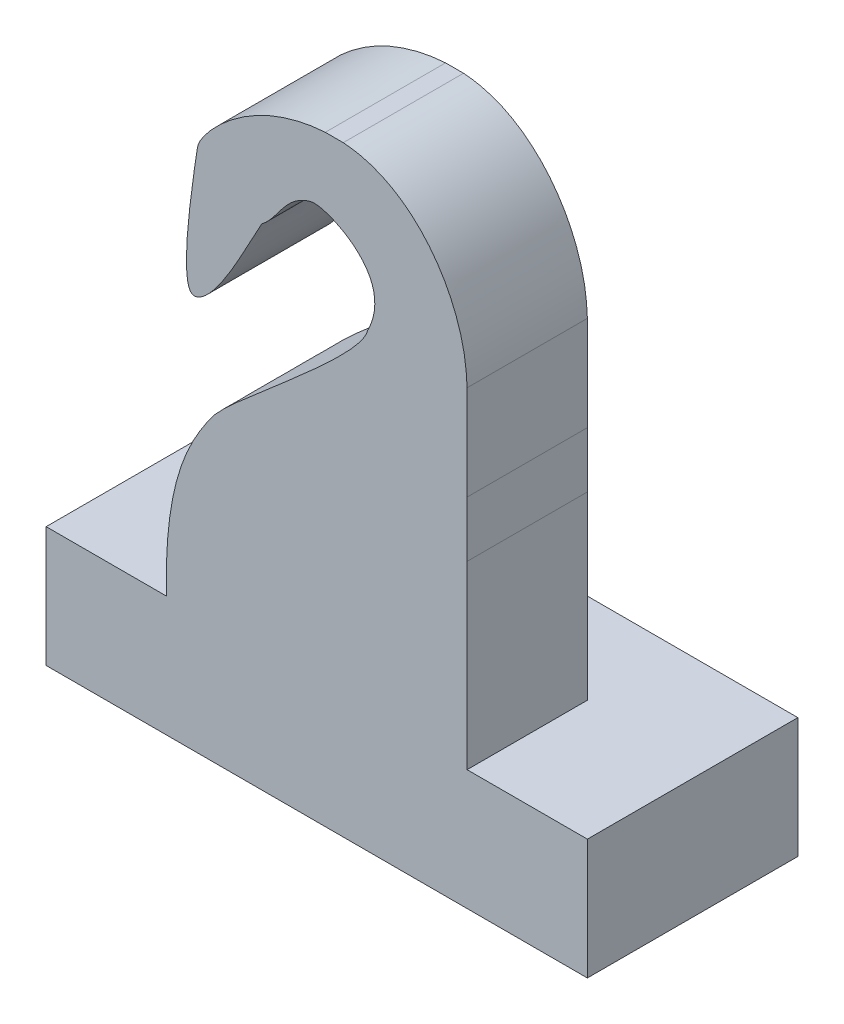
ISO-10303-21;
HEADER;
FILE_DESCRIPTION(('STEP AP214'),'2;1');
FILE_NAME('part.step','',(''),(''),'','','');
FILE_SCHEMA(('AUTOMOTIVE_DESIGN { 1 0 10303 214 1 1 1 1 }'));
ENDSEC;
DATA;
#1=APPLICATION_CONTEXT('core data for automotive mechanical design processes');
#2=APPLICATION_PROTOCOL_DEFINITION('international standard','automotive_design',2000,#1);
#3=PRODUCT_CONTEXT('',#1,'mechanical');
#4=PRODUCT('Part','Part','',(#3));
#5=PRODUCT_RELATED_PRODUCT_CATEGORY('part','',(#4));
#6=PRODUCT_DEFINITION_FORMATION('','',#4);
#7=PRODUCT_DEFINITION_CONTEXT('part definition',#1,'design');
#8=PRODUCT_DEFINITION('design','',#6,#7);
#9=PRODUCT_DEFINITION_SHAPE('','',#8);
#10=(LENGTH_UNIT() NAMED_UNIT(*) SI_UNIT(.MILLI.,.METRE.));
#11=(NAMED_UNIT(*) PLANE_ANGLE_UNIT() SI_UNIT($,.RADIAN.));
#12=(NAMED_UNIT(*) SI_UNIT($,.STERADIAN.) SOLID_ANGLE_UNIT());
#13=UNCERTAINTY_MEASURE_WITH_UNIT(LENGTH_MEASURE(1.E-05),#10,'distance_accuracy_value','');
#14=(GEOMETRIC_REPRESENTATION_CONTEXT(3) GLOBAL_UNCERTAINTY_ASSIGNED_CONTEXT((#13)) GLOBAL_UNIT_ASSIGNED_CONTEXT((#10,
#11,#12)) REPRESENTATION_CONTEXT('',''));
#15=CARTESIAN_POINT('',(0.,0.,0.));
#16=DIRECTION('',(0.,0.,1.));
#17=DIRECTION('',(1.,0.,0.));
#18=AXIS2_PLACEMENT_3D('',#15,#16,#17);
#19=CARTESIAN_POINT('',(2.5,2.,2.5));
#20=DIRECTION('',(-1.,0.,0.));
#21=DIRECTION('',(0.,0.,1.));
#22=AXIS2_PLACEMENT_3D('',#19,#20,#21);
#23=PLANE('',#22);
#24=DIRECTION('',(0.,-1.,0.));
#25=VECTOR('',#24,1.);
#26=CARTESIAN_POINT('',(2.5,10.,1.));
#27=LINE('',#26,#25);
#28=CARTESIAN_POINT('',(2.5,5.,1.));
#29=VERTEX_POINT('',#28);
#30=CARTESIAN_POINT('',(2.5,2.,1.));
#31=VERTEX_POINT('',#30);
#32=EDGE_CURVE('E135',#29,#31,#27,.T.);
#33=ORIENTED_EDGE('',*,*,#32,.T.);
#34=DIRECTION('',(0.,0.,-1.));
#35=VECTOR('',#34,1.);
#36=CARTESIAN_POINT('',(2.5,2.,2.5));
#37=LINE('',#36,#35);
#38=CARTESIAN_POINT('',(2.5,2.,-1.));
#39=VERTEX_POINT('',#38);
#40=EDGE_CURVE('E138',#31,#39,#37,.T.);
#41=ORIENTED_EDGE('',*,*,#40,.T.);
#42=DIRECTION('',(0.,-1.,0.));
#43=VECTOR('',#42,1.);
#44=CARTESIAN_POINT('',(2.5,10.,-1.));
#45=LINE('',#44,#43);
#46=CARTESIAN_POINT('',(2.5,5.,-1.));
#47=VERTEX_POINT('',#46);
#48=EDGE_CURVE('E222',#47,#39,#45,.T.);
#49=ORIENTED_EDGE('',*,*,#48,.F.);
#50=DIRECTION('',(0.,0.,1.));
#51=VECTOR('',#50,1.);
#52=CARTESIAN_POINT('',(2.5,5.,-2.500025));
#53=LINE('',#52,#51);
#54=EDGE_CURVE('E140',#47,#29,#53,.T.);
#55=ORIENTED_EDGE('',*,*,#54,.T.);
#56=EDGE_LOOP('',(#33,#41,#49,#55));
#57=FACE_BOUND('',#56,.T.);
#58=ADVANCED_FACE('F34',(#57),#23,.F.);
#59=DIRECTION('',(0.,0.,1.));
#60=VECTOR('',#59,1.);
#61=CARTESIAN_POINT('',(2.49999999999981,5.92572640395759,-2.500025));
#62=LINE('',#61,#60);
#63=CARTESIAN_POINT('',(2.4999999999999,5.92572640395759,-1.));
#64=VERTEX_POINT('',#63);
#65=CARTESIAN_POINT('',(2.5,5.92572638119853,1.));
#66=VERTEX_POINT('',#65);
#67=EDGE_CURVE('E49',#64,#66,#62,.T.);
#68=ORIENTED_EDGE('',*,*,#67,.F.);
#69=CARTESIAN_POINT('',(2.5,7.50000000000013,-1.));
#70=VERTEX_POINT('',#69);
#71=EDGE_CURVE('E310',#70,#64,#45,.T.);
#72=ORIENTED_EDGE('',*,*,#71,.F.);
#73=DIRECTION('',(0.,0.,1.));
#74=VECTOR('',#73,1.);
#75=CARTESIAN_POINT('',(2.5,7.49999999999997,-2.500025));
#76=LINE('',#75,#74);
#77=CARTESIAN_POINT('',(2.5,7.50000000000013,1.));
#78=VERTEX_POINT('',#77);
#79=EDGE_CURVE('E348',#78,#70,#76,.F.);
#80=ORIENTED_EDGE('',*,*,#79,.F.);
#81=EDGE_CURVE('E143',#78,#66,#27,.T.);
#82=ORIENTED_EDGE('',*,*,#81,.T.);
#83=EDGE_LOOP('',(#68,#72,#80,#82));
#84=FACE_BOUND('',#83,.T.);
#85=ADVANCED_FACE('F297',(#84),#23,.F.);
#86=CARTESIAN_POINT('',(-2.5,10.,-1.));
#87=DIRECTION('',(0.,0.,1.));
#88=DIRECTION('',(1.,0.,0.));
#89=AXIS2_PLACEMENT_3D('',#86,#87,#88);
#90=PLANE('',#89);
#91=CARTESIAN_POINT('',(2.5,4.99999999999999,-1.));
#92=CARTESIAN_POINT('',(2.49589033919262,5.3238455114131,-1.));
#93=CARTESIAN_POINT('',(2.49736885786771,5.62624553345062,-1.));
#94=CARTESIAN_POINT('',(2.49999999999981,5.92572640395759,-1.));
#95=B_SPLINE_CURVE_WITH_KNOTS('',3,(#91,#92,#93,#94),.UNSPECIFIED.,.F.,.F.,(4,4),(0.,
0.0676005936664288),.UNSPECIFIED.);
#96=EDGE_CURVE('E312',#47,#64,#95,.T.);
#97=ORIENTED_EDGE('',*,*,#96,.F.);
#98=ORIENTED_EDGE('',*,*,#48,.T.);
#99=DIRECTION('',(-1.,0.,0.));
#100=VECTOR('',#99,1.);
#101=CARTESIAN_POINT('',(-2.5,2.,-1.));
#102=LINE('',#101,#100);
#103=CARTESIAN_POINT('',(-2.5,2.,-1.));
#104=VERTEX_POINT('',#103);
#105=EDGE_CURVE('E154',#39,#104,#102,.T.);
#106=ORIENTED_EDGE('',*,*,#105,.T.);
#107=DIRECTION('',(0.,-1.,0.));
#108=VECTOR('',#107,1.);
#109=CARTESIAN_POINT('',(-2.5,10.,-1.));
#110=LINE('',#109,#108);
#111=CARTESIAN_POINT('',(-2.5,2.45113593006876,-1.));
#112=VERTEX_POINT('',#111);
#113=EDGE_CURVE('E218',#112,#104,#110,.T.);
#114=ORIENTED_EDGE('',*,*,#113,.F.);
#115=CARTESIAN_POINT('',(0.846399905186923,7.50000000000001,-1.));
#116=CARTESIAN_POINT('',(0.733429790840664,7.04375399604097,-1.));
#117=CARTESIAN_POINT('',(-1.46492465911326,5.35390022613394,-1.));
#118=CARTESIAN_POINT('',(-2.07816339811987,4.48956577341703,-1.));
#119=CARTESIAN_POINT('',(-2.53979583866904,3.63685244014865,-1.));
#120=CARTESIAN_POINT('',(-2.5,2.,-1.));
#121=B_SPLINE_CURVE_WITH_KNOTS('',3,(#115,#116,#117,#118,#119,#120),.UNSPECIFIED.,.F.,.F.,(4,1,
1,4),(0.,0.389814199321812,0.489814199321812,1.),.UNSPECIFIED.);
#122=CARTESIAN_POINT('',(0.846399905186923,7.50000000000001,-1.));
#123=VERTEX_POINT('',#122);
#124=EDGE_CURVE('E227',#123,#112,#121,.T.);
#125=ORIENTED_EDGE('',*,*,#124,.F.);
#126=CARTESIAN_POINT('',(-0.913797876336708,8.15435335652131,-1.));
#127=CARTESIAN_POINT('',(-0.648759023753295,8.34710888567288,-1.));
#128=CARTESIAN_POINT('',(-0.531494103816482,8.78498809469441,-1.));
#129=CARTESIAN_POINT('',(0.146387491870617,8.94336174341602,-1.));
#130=CARTESIAN_POINT('',(1.26948792852301,8.33205645916082,-1.));
#131=CARTESIAN_POINT('',(0.846399905186921,7.5,-1.));
#132=B_SPLINE_CURVE_WITH_KNOTS('',3,(#126,#127,#128,#129,#130,#131),.UNSPECIFIED.,.F.,.F.,(4,1,
1,4),(0.,0.636793482911564,0.736793482911564,1.),.UNSPECIFIED.);
#133=CARTESIAN_POINT('',(-0.913797876336708,8.15435335652131,-1.));
#134=VERTEX_POINT('',#133);
#135=EDGE_CURVE('E342',#134,#123,#132,.T.);
#136=ORIENTED_EDGE('',*,*,#135,.F.);
#137=CARTESIAN_POINT('',(2.5,4.99999999999999,-1.));
#138=CARTESIAN_POINT('',(2.49007762198309,5.78189362429881,-1.));
#139=CARTESIAN_POINT('',(2.5185939913796,6.60879597252504,-1.));
#140=CARTESIAN_POINT('',(2.48216557116695,8.62899466353741,-1.));
#141=CARTESIAN_POINT('',(1.4312796744746,10.1046934894448,-1.));
#142=CARTESIAN_POINT('',(-1.04972267407301,9.922936438262,-1.));
#143=CARTESIAN_POINT('',(-1.95055727861318,8.93686203342009,-1.));
#144=CARTESIAN_POINT('',(-2.00518478576261,8.58785633115242,-1.));
#145=CARTESIAN_POINT('',(-2.3250371117742,6.45528619828981,-1.));
#146=CARTESIAN_POINT('',(-1.65527522698245,6.650653781453,-1.));
#147=CARTESIAN_POINT('',(-1.14029070231076,7.76401465643836,-1.));
#148=CARTESIAN_POINT('',(-0.913797876336707,8.15435335652131,-1.));
#149=B_SPLINE_CURVE_WITH_KNOTS('',3,(#137,#138,#139,#140,#141,#142,#143,#144,#145,#146,#147,
#148),.UNSPECIFIED.,.F.,.F.,(4,1,1,1,1,1,1,1,1,4),(0.,0.163215086588525,0.205460406152552,
0.398342885697188,0.445021291960526,0.625566062522596,0.664836846691589,0.798458349481464,
0.833644933597179,1.),.UNSPECIFIED.);
#150=CARTESIAN_POINT('',(0.141785375792142,10.,-1.));
#151=VERTEX_POINT('',#150);
#152=EDGE_CURVE('E337',#151,#134,#149,.T.);
#153=ORIENTED_EDGE('',*,*,#152,.F.);
#154=DIRECTION('',(-1.,0.,0.));
#155=VECTOR('',#154,1.);
#156=CARTESIAN_POINT('',(-2.5,10.,-1.));
#157=LINE('',#156,#155);
#158=CARTESIAN_POINT('',(0.440648573603054,10.,-1.));
#159=VERTEX_POINT('',#158);
#160=EDGE_CURVE('E226',#159,#151,#157,.T.);
#161=ORIENTED_EDGE('',*,*,#160,.F.);
#162=EDGE_CURVE('E318',#70,#159,#149,.T.);
#163=ORIENTED_EDGE('',*,*,#162,.F.);
#164=ORIENTED_EDGE('',*,*,#71,.T.);
#165=EDGE_LOOP('',(#97,#98,#106,#114,#125,#136,#153,#161,#163,#164));
#166=FACE_BOUND('',#165,.T.);
#167=ADVANCED_FACE('F225',(#166),#90,.F.);
#168=CARTESIAN_POINT('',(-2.5,10.,1.));
#169=DIRECTION('',(0.,0.,-1.));
#170=DIRECTION('',(-1.,0.,0.));
#171=AXIS2_PLACEMENT_3D('',#168,#169,#170);
#172=PLANE('',#171);
#173=CARTESIAN_POINT('',(2.5,4.99999999999999,1.));
#174=CARTESIAN_POINT('',(2.49007762198309,5.78189362429881,1.));
#175=CARTESIAN_POINT('',(2.5185939913796,6.60879597252504,1.));
#176=CARTESIAN_POINT('',(2.48216557116695,8.62899466353741,1.));
#177=CARTESIAN_POINT('',(1.4312796744746,10.1046934894448,1.));
#178=CARTESIAN_POINT('',(-1.04972267407301,9.922936438262,1.));
#179=CARTESIAN_POINT('',(-1.95055727861318,8.93686203342009,1.));
#180=CARTESIAN_POINT('',(-2.00518478576261,8.58785633115242,1.));
#181=CARTESIAN_POINT('',(-2.3250371117742,6.45528619828981,1.));
#182=CARTESIAN_POINT('',(-1.65527522698245,6.650653781453,1.));
#183=CARTESIAN_POINT('',(-1.14029070231076,7.76401465643836,1.));
#184=CARTESIAN_POINT('',(-0.913797876336707,8.15435335652131,1.));
#185=B_SPLINE_CURVE_WITH_KNOTS('',3,(#173,#174,#175,#176,#177,#178,#179,#180,#181,#182,#183,
#184),.UNSPECIFIED.,.F.,.F.,(4,1,1,1,1,1,1,1,1,4),(0.,0.163215086588525,0.205460406152552,
0.398342885697188,0.445021291960526,0.625566062522596,0.664836846691589,0.798458349481464,
0.833644933597179,1.),.UNSPECIFIED.);
#186=CARTESIAN_POINT('',(0.440648573603055,10.,1.));
#187=VERTEX_POINT('',#186);
#188=EDGE_CURVE('E343',#187,#78,#185,.F.);
#189=ORIENTED_EDGE('',*,*,#188,.F.);
#190=DIRECTION('',(1.,0.,0.));
#191=VECTOR('',#190,1.);
#192=CARTESIAN_POINT('',(-2.5,10.,1.));
#193=LINE('',#192,#191);
#194=CARTESIAN_POINT('',(0.141785375792142,10.,1.));
#195=VERTEX_POINT('',#194);
#196=EDGE_CURVE('E144',#195,#187,#193,.T.);
#197=ORIENTED_EDGE('',*,*,#196,.F.);
#198=CARTESIAN_POINT('',(-0.913797876336708,8.15435335652131,1.));
#199=VERTEX_POINT('',#198);
#200=EDGE_CURVE('E57',#199,#195,#185,.F.);
#201=ORIENTED_EDGE('',*,*,#200,.F.);
#202=CARTESIAN_POINT('',(-0.913797876336708,8.15435335652131,1.));
#203=CARTESIAN_POINT('',(-0.648759023753295,8.34710888567288,1.));
#204=CARTESIAN_POINT('',(-0.531494103816482,8.78498809469441,1.));
#205=CARTESIAN_POINT('',(0.146387491870617,8.94336174341602,1.));
#206=CARTESIAN_POINT('',(1.26948792852301,8.33205645916082,1.));
#207=CARTESIAN_POINT('',(0.846399905186921,7.5,1.));
#208=B_SPLINE_CURVE_WITH_KNOTS('',3,(#202,#203,#204,#205,#206,#207),.UNSPECIFIED.,.F.,.F.,(4,1,
1,4),(0.,0.636793482911564,0.736793482911564,1.),.UNSPECIFIED.);
#209=CARTESIAN_POINT('',(0.846399905186923,7.50000000000001,1.));
#210=VERTEX_POINT('',#209);
#211=EDGE_CURVE('E335',#210,#199,#208,.F.);
#212=ORIENTED_EDGE('',*,*,#211,.F.);
#213=CARTESIAN_POINT('',(0.846399905186923,7.50000000000001,1.));
#214=CARTESIAN_POINT('',(0.733429790840664,7.04375399604097,1.));
#215=CARTESIAN_POINT('',(-1.46492465911326,5.35390022613394,1.));
#216=CARTESIAN_POINT('',(-2.07816339811987,4.48956577341703,1.));
#217=CARTESIAN_POINT('',(-2.53979583866904,3.63685244014865,1.));
#218=CARTESIAN_POINT('',(-2.5,2.,1.));
#219=B_SPLINE_CURVE_WITH_KNOTS('',3,(#213,#214,#215,#216,#217,#218),.UNSPECIFIED.,.F.,.F.,(4,1,
1,4),(0.,0.389814199321812,0.489814199321812,1.),.UNSPECIFIED.);
#220=CARTESIAN_POINT('',(-2.49999999999998,2.45113593006974,1.));
#221=VERTEX_POINT('',#220);
#222=EDGE_CURVE('E42',#221,#210,#219,.F.);
#223=ORIENTED_EDGE('',*,*,#222,.F.);
#224=DIRECTION('',(0.,-1.,0.));
#225=VECTOR('',#224,1.);
#226=CARTESIAN_POINT('',(-2.5,10.,1.));
#227=LINE('',#226,#225);
#228=CARTESIAN_POINT('',(-2.5,2.,1.));
#229=VERTEX_POINT('',#228);
#230=EDGE_CURVE('E213',#221,#229,#227,.T.);
#231=ORIENTED_EDGE('',*,*,#230,.T.);
#232=DIRECTION('',(1.,0.,0.));
#233=VECTOR('',#232,1.);
#234=CARTESIAN_POINT('',(-4.5,2.,1.));
#235=LINE('',#234,#233);
#236=CARTESIAN_POINT('',(-4.5,2.,1.));
#237=VERTEX_POINT('',#236);
#238=EDGE_CURVE('E156',#237,#229,#235,.T.);
#239=ORIENTED_EDGE('',*,*,#238,.F.);
#240=DIRECTION('',(0.,-1.,0.));
#241=VECTOR('',#240,1.);
#242=CARTESIAN_POINT('',(-4.5,2.,1.));
#243=LINE('',#242,#241);
#244=CARTESIAN_POINT('',(-4.5,0.,1.));
#245=VERTEX_POINT('',#244);
#246=EDGE_CURVE('E183',#237,#245,#243,.T.);
#247=ORIENTED_EDGE('',*,*,#246,.T.);
#248=DIRECTION('',(1.,0.,0.));
#249=VECTOR('',#248,1.);
#250=CARTESIAN_POINT('',(-4.5,0.,1.));
#251=LINE('',#250,#249);
#252=CARTESIAN_POINT('',(4.5,0.,1.));
#253=VERTEX_POINT('',#252);
#254=EDGE_CURVE('E163',#245,#253,#251,.T.);
#255=ORIENTED_EDGE('',*,*,#254,.T.);
#256=DIRECTION('',(0.,-1.,0.));
#257=VECTOR('',#256,1.);
#258=CARTESIAN_POINT('',(4.5,2.,1.));
#259=LINE('',#258,#257);
#260=CARTESIAN_POINT('',(4.5,2.,1.));
#261=VERTEX_POINT('',#260);
#262=EDGE_CURVE('E162',#261,#253,#259,.T.);
#263=ORIENTED_EDGE('',*,*,#262,.F.);
#264=EDGE_CURVE('E150',#31,#261,#235,.T.);
#265=ORIENTED_EDGE('',*,*,#264,.F.);
#266=ORIENTED_EDGE('',*,*,#32,.F.);
#267=CARTESIAN_POINT('',(2.49999999979986,5.9257263811994,1.));
#268=CARTESIAN_POINT('',(2.49736885779281,5.62624551813061,1.));
#269=CARTESIAN_POINT('',(2.49589033929672,5.32384550320986,1.));
#270=CARTESIAN_POINT('',(2.5,4.99999999999999,1.));
#271=B_SPLINE_CURVE_WITH_KNOTS('',3,(#267,#268,#269,#270),.UNSPECIFIED.,.F.,.F.,(4,4),(0.,
0.0676005919540581),.UNSPECIFIED.);
#272=EDGE_CURVE('E313',#66,#29,#271,.T.);
#273=ORIENTED_EDGE('',*,*,#272,.F.);
#274=ORIENTED_EDGE('',*,*,#81,.F.);
#275=EDGE_LOOP('',(#189,#197,#201,#212,#223,#231,#239,#247,#255,#263,#265,#266,#273,#274));
#276=FACE_BOUND('',#275,.T.);
#277=ADVANCED_FACE('F160',(#276),#172,.F.);
#278=CARTESIAN_POINT('',(0.,10.,0.));
#279=DIRECTION('',(0.,-1.,0.));
#280=DIRECTION('',(0.,0.,-1.));
#281=AXIS2_PLACEMENT_3D('',#278,#279,#280);
#282=PLANE('',#281);
#283=DIRECTION('',(0.,0.,1.));
#284=VECTOR('',#283,1.);
#285=CARTESIAN_POINT('',(0.440648573603055,10.,-2.500025));
#286=LINE('',#285,#284);
#287=EDGE_CURVE('E334',#159,#187,#286,.T.);
#288=ORIENTED_EDGE('',*,*,#287,.F.);
#289=ORIENTED_EDGE('',*,*,#160,.T.);
#290=DIRECTION('',(0.,0.,1.));
#291=VECTOR('',#290,1.);
#292=CARTESIAN_POINT('',(0.141785375792142,10.,-2.500025));
#293=LINE('',#292,#291);
#294=EDGE_CURVE('E201',#195,#151,#293,.F.);
#295=ORIENTED_EDGE('',*,*,#294,.F.);
#296=ORIENTED_EDGE('',*,*,#196,.T.);
#297=EDGE_LOOP('',(#288,#289,#295,#296));
#298=FACE_BOUND('',#297,.T.);
#299=ADVANCED_FACE('F262',(#298),#282,.F.);
#300=CARTESIAN_POINT('',(0.,2.,0.));
#301=DIRECTION('',(0.,-1.,0.));
#302=DIRECTION('',(0.,0.,-1.));
#303=AXIS2_PLACEMENT_3D('',#300,#301,#302);
#304=PLANE('',#303);
#305=ORIENTED_EDGE('',*,*,#105,.F.);
#306=ORIENTED_EDGE('',*,*,#40,.F.);
#307=ORIENTED_EDGE('',*,*,#264,.T.);
#308=DIRECTION('',(0.,0.,1.));
#309=VECTOR('',#308,1.);
#310=CARTESIAN_POINT('',(4.5,2.,1.));
#311=LINE('',#310,#309);
#312=CARTESIAN_POINT('',(4.5,2.,-2.5));
#313=VERTEX_POINT('',#312);
#314=EDGE_CURVE('E186',#313,#261,#311,.T.);
#315=ORIENTED_EDGE('',*,*,#314,.F.);
#316=DIRECTION('',(-1.,0.,0.));
#317=VECTOR('',#316,1.);
#318=CARTESIAN_POINT('',(-2.5,2.,-2.5));
#319=LINE('',#318,#317);
#320=CARTESIAN_POINT('',(-4.5,2.,-2.5));
#321=VERTEX_POINT('',#320);
#322=EDGE_CURVE('E198',#313,#321,#319,.T.);
#323=ORIENTED_EDGE('',*,*,#322,.T.);
#324=DIRECTION('',(0.,0.,1.));
#325=VECTOR('',#324,1.);
#326=CARTESIAN_POINT('',(-4.5,2.,1.));
#327=LINE('',#326,#325);
#328=EDGE_CURVE('E167',#321,#237,#327,.T.);
#329=ORIENTED_EDGE('',*,*,#328,.T.);
#330=ORIENTED_EDGE('',*,*,#238,.T.);
#331=DIRECTION('',(0.,0.,1.));
#332=VECTOR('',#331,1.);
#333=CARTESIAN_POINT('',(-2.5,2.,2.5));
#334=LINE('',#333,#332);
#335=EDGE_CURVE('E12',#104,#229,#334,.T.);
#336=ORIENTED_EDGE('',*,*,#335,.F.);
#337=EDGE_LOOP('',(#305,#306,#307,#315,#323,#329,#330,#336));
#338=FACE_BOUND('',#337,.T.);
#339=ADVANCED_FACE('F148',(#338),#304,.F.);
#340=CARTESIAN_POINT('',(-2.5,2.,-2.5));
#341=DIRECTION('',(0.,0.,1.));
#342=DIRECTION('',(1.,0.,0.));
#343=AXIS2_PLACEMENT_3D('',#340,#341,#342);
#344=PLANE('',#343);
#345=DIRECTION('',(-1.,0.,0.));
#346=VECTOR('',#345,1.);
#347=CARTESIAN_POINT('',(-2.5,0.,-2.5));
#348=LINE('',#347,#346);
#349=CARTESIAN_POINT('',(4.5,0.,-2.5));
#350=VERTEX_POINT('',#349);
#351=CARTESIAN_POINT('',(-4.5,0.,-2.5));
#352=VERTEX_POINT('',#351);
#353=EDGE_CURVE('E202',#350,#352,#348,.T.);
#354=ORIENTED_EDGE('',*,*,#353,.T.);
#355=DIRECTION('',(0.,1.,0.));
#356=VECTOR('',#355,1.);
#357=CARTESIAN_POINT('',(-4.5,2.,-2.5));
#358=LINE('',#357,#356);
#359=EDGE_CURVE('E177',#352,#321,#358,.T.);
#360=ORIENTED_EDGE('',*,*,#359,.T.);
#361=ORIENTED_EDGE('',*,*,#322,.F.);
#362=DIRECTION('',(0.,1.,0.));
#363=VECTOR('',#362,1.);
#364=CARTESIAN_POINT('',(4.5,2.,-2.5));
#365=LINE('',#364,#363);
#366=EDGE_CURVE('E188',#350,#313,#365,.T.);
#367=ORIENTED_EDGE('',*,*,#366,.F.);
#368=EDGE_LOOP('',(#354,#360,#361,#367));
#369=FACE_BOUND('',#368,.T.);
#370=ADVANCED_FACE('F205',(#369),#344,.F.);
#371=CARTESIAN_POINT('',(-2.5,2.,2.5));
#372=DIRECTION('',(1.,0.,0.));
#373=DIRECTION('',(0.,0.,-1.));
#374=AXIS2_PLACEMENT_3D('',#371,#372,#373);
#375=PLANE('',#374);
#376=ORIENTED_EDGE('',*,*,#113,.T.);
#377=ORIENTED_EDGE('',*,*,#335,.T.);
#378=ORIENTED_EDGE('',*,*,#230,.F.);
#379=DIRECTION('',(0.,0.,1.));
#380=VECTOR('',#379,1.);
#381=CARTESIAN_POINT('',(-2.5,2.45113593006876,-2.500025));
#382=LINE('',#381,#380);
#383=EDGE_CURVE('E219',#112,#221,#382,.T.);
#384=ORIENTED_EDGE('',*,*,#383,.F.);
#385=EDGE_LOOP('',(#376,#377,#378,#384));
#386=FACE_BOUND('',#385,.T.);
#387=ADVANCED_FACE('F215',(#386),#375,.F.);
#388=CARTESIAN_POINT('',(0.,0.,0.));
#389=DIRECTION('',(0.,-1.,0.));
#390=DIRECTION('',(0.,0.,-1.));
#391=AXIS2_PLACEMENT_3D('',#388,#389,#390);
#392=PLANE('',#391);
#393=ORIENTED_EDGE('',*,*,#254,.F.);
#394=DIRECTION('',(0.,0.,-1.));
#395=VECTOR('',#394,1.);
#396=CARTESIAN_POINT('',(-4.5,0.,1.));
#397=LINE('',#396,#395);
#398=EDGE_CURVE('E180',#245,#352,#397,.T.);
#399=ORIENTED_EDGE('',*,*,#398,.T.);
#400=ORIENTED_EDGE('',*,*,#353,.F.);
#401=DIRECTION('',(0.,0.,-1.));
#402=VECTOR('',#401,1.);
#403=CARTESIAN_POINT('',(4.5,0.,1.));
#404=LINE('',#403,#402);
#405=EDGE_CURVE('E191',#253,#350,#404,.T.);
#406=ORIENTED_EDGE('',*,*,#405,.F.);
#407=EDGE_LOOP('',(#393,#399,#400,#406));
#408=FACE_BOUND('',#407,.T.);
#409=ADVANCED_FACE('F395',(#408),#392,.T.);
#410=CARTESIAN_POINT('',(2.5,4.99999999999999,-2.500025));
#411=CARTESIAN_POINT('',(2.49007762198309,5.78189362429881,-2.500025));
#412=CARTESIAN_POINT('',(2.5185939913796,6.60879597252504,-2.500025));
#413=CARTESIAN_POINT('',(2.48216557116695,8.62899466353741,-2.500025));
#414=CARTESIAN_POINT('',(1.4312796744746,10.1046934894448,-2.500025));
#415=CARTESIAN_POINT('',(-1.04972267407301,9.922936438262,-2.500025));
#416=CARTESIAN_POINT('',(-1.95055727861318,8.93686203342009,-2.500025));
#417=CARTESIAN_POINT('',(-2.00518478576261,8.58785633115242,-2.500025));
#418=CARTESIAN_POINT('',(-2.3250371117742,6.45528619828981,-2.500025));
#419=CARTESIAN_POINT('',(-1.65527522698245,6.650653781453,-2.500025));
#420=CARTESIAN_POINT('',(-1.14029070231076,7.76401465643836,-2.500025));
#421=CARTESIAN_POINT('',(-0.913797876336707,8.15435335652131,-2.500025));
#422=B_SPLINE_CURVE_WITH_KNOTS('',3,(#410,#411,#412,#413,#414,#415,#416,#417,#418,#419,#420,
#421),.UNSPECIFIED.,.F.,.F.,(4,1,1,1,1,1,1,1,1,4),(0.,0.163215086588525,0.205460406152552,
0.398342885697188,0.445021291960526,0.625566062522596,0.664836846691589,0.798458349481464,
0.833644933597179,1.),.UNSPECIFIED.);
#423=DIRECTION('',(0.,0.,1.));
#424=VECTOR('',#423,1.);
#425=SURFACE_OF_LINEAR_EXTRUSION('',#422,#424);
#426=ORIENTED_EDGE('',*,*,#152,.T.);
#427=DIRECTION('',(0.,0.,1.));
#428=VECTOR('',#427,1.);
#429=CARTESIAN_POINT('',(-0.913797876336708,8.15435335652131,-2.500025));
#430=LINE('',#429,#428);
#431=EDGE_CURVE('E155',#134,#199,#430,.T.);
#432=ORIENTED_EDGE('',*,*,#431,.T.);
#433=ORIENTED_EDGE('',*,*,#200,.T.);
#434=ORIENTED_EDGE('',*,*,#294,.T.);
#435=EDGE_LOOP('',(#426,#432,#433,#434));
#436=FACE_BOUND('',#435,.T.);
#437=ADVANCED_FACE('F258',(#436),#425,.T.);
#438=CARTESIAN_POINT('',(-0.913797876336708,8.15435335652131,-2.500025));
#439=CARTESIAN_POINT('',(-0.648759023753295,8.34710888567288,-2.500025));
#440=CARTESIAN_POINT('',(-0.531494103816482,8.78498809469441,-2.500025));
#441=CARTESIAN_POINT('',(0.146387491870617,8.94336174341602,-2.500025));
#442=CARTESIAN_POINT('',(1.26948792852301,8.33205645916082,-2.500025));
#443=CARTESIAN_POINT('',(0.846399905186921,7.5,-2.500025));
#444=B_SPLINE_CURVE_WITH_KNOTS('',3,(#438,#439,#440,#441,#442,#443),.UNSPECIFIED.,.F.,.F.,(4,1,
1,4),(0.,0.636793482911564,0.736793482911564,1.),.UNSPECIFIED.);
#445=DIRECTION('',(0.,0.,1.));
#446=VECTOR('',#445,1.);
#447=SURFACE_OF_LINEAR_EXTRUSION('',#444,#446);
#448=ORIENTED_EDGE('',*,*,#135,.T.);
#449=DIRECTION('',(0.,0.,1.));
#450=VECTOR('',#449,1.);
#451=CARTESIAN_POINT('',(0.846399905186923,7.50000000000001,-2.500025));
#452=LINE('',#451,#450);
#453=EDGE_CURVE('E352',#123,#210,#452,.T.);
#454=ORIENTED_EDGE('',*,*,#453,.T.);
#455=ORIENTED_EDGE('',*,*,#211,.T.);
#456=ORIENTED_EDGE('',*,*,#431,.F.);
#457=EDGE_LOOP('',(#448,#454,#455,#456));
#458=FACE_BOUND('',#457,.T.);
#459=ADVANCED_FACE('F259',(#458),#447,.T.);
#460=CARTESIAN_POINT('',(0.846399905186923,7.50000000000001,-2.500025));
#461=CARTESIAN_POINT('',(0.733429790840664,7.04375399604097,-2.500025));
#462=CARTESIAN_POINT('',(-1.46492465911326,5.35390022613394,-2.500025));
#463=CARTESIAN_POINT('',(-2.07816339811987,4.48956577341703,-2.500025));
#464=CARTESIAN_POINT('',(-2.53979583866904,3.63685244014865,-2.500025));
#465=CARTESIAN_POINT('',(-2.5,2.,-2.500025));
#466=B_SPLINE_CURVE_WITH_KNOTS('',3,(#460,#461,#462,#463,#464,#465),.UNSPECIFIED.,.F.,.F.,(4,1,
1,4),(0.,0.389814199321812,0.489814199321812,1.),.UNSPECIFIED.);
#467=DIRECTION('',(0.,0.,1.));
#468=VECTOR('',#467,1.);
#469=SURFACE_OF_LINEAR_EXTRUSION('',#466,#468);
#470=ORIENTED_EDGE('',*,*,#124,.T.);
#471=ORIENTED_EDGE('',*,*,#383,.T.);
#472=ORIENTED_EDGE('',*,*,#222,.T.);
#473=ORIENTED_EDGE('',*,*,#453,.F.);
#474=EDGE_LOOP('',(#470,#471,#472,#473));
#475=FACE_BOUND('',#474,.T.);
#476=ADVANCED_FACE('F287',(#475),#469,.T.);
#477=ORIENTED_EDGE('',*,*,#79,.T.);
#478=ORIENTED_EDGE('',*,*,#162,.T.);
#479=ORIENTED_EDGE('',*,*,#287,.T.);
#480=ORIENTED_EDGE('',*,*,#188,.T.);
#481=EDGE_LOOP('',(#477,#478,#479,#480));
#482=FACE_BOUND('',#481,.T.);
#483=ADVANCED_FACE('F257',(#482),#425,.T.);
#484=ORIENTED_EDGE('',*,*,#96,.T.);
#485=ORIENTED_EDGE('',*,*,#67,.T.);
#486=ORIENTED_EDGE('',*,*,#272,.T.);
#487=ORIENTED_EDGE('',*,*,#54,.F.);
#488=EDGE_LOOP('',(#484,#485,#486,#487));
#489=FACE_BOUND('',#488,.T.);
#490=ADVANCED_FACE('F246',(#489),#425,.T.);
#491=CARTESIAN_POINT('',(-4.5,0.,0.));
#492=DIRECTION('',(1.,0.,0.));
#493=DIRECTION('',(0.,0.,-1.));
#494=AXIS2_PLACEMENT_3D('',#491,#492,#493);
#495=PLANE('',#494);
#496=ORIENTED_EDGE('',*,*,#246,.F.);
#497=ORIENTED_EDGE('',*,*,#328,.F.);
#498=ORIENTED_EDGE('',*,*,#359,.F.);
#499=ORIENTED_EDGE('',*,*,#398,.F.);
#500=EDGE_LOOP('',(#496,#497,#498,#499));
#501=FACE_BOUND('',#500,.T.);
#502=ADVANCED_FACE('F209',(#501),#495,.F.);
#503=CARTESIAN_POINT('',(4.5,0.,0.));
#504=DIRECTION('',(1.,0.,0.));
#505=DIRECTION('',(0.,0.,-1.));
#506=AXIS2_PLACEMENT_3D('',#503,#504,#505);
#507=PLANE('',#506);
#508=ORIENTED_EDGE('',*,*,#262,.T.);
#509=ORIENTED_EDGE('',*,*,#405,.T.);
#510=ORIENTED_EDGE('',*,*,#366,.T.);
#511=ORIENTED_EDGE('',*,*,#314,.T.);
#512=EDGE_LOOP('',(#508,#509,#510,#511));
#513=FACE_BOUND('',#512,.T.);
#514=ADVANCED_FACE('F195',(#513),#507,.T.);
#515=CLOSED_SHELL('',(#58,#85,#167,#277,#299,#339,#370,#387,#409,#437,#459,#476,#483,#490,#502,#514));
#516=MANIFOLD_SOLID_BREP('B2',#515);
#517=ADVANCED_BREP_SHAPE_REPRESENTATION('',(#18,#516),#14);
#518=SHAPE_DEFINITION_REPRESENTATION(#9,#517);
ENDSEC;
END-ISO-10303-21;
